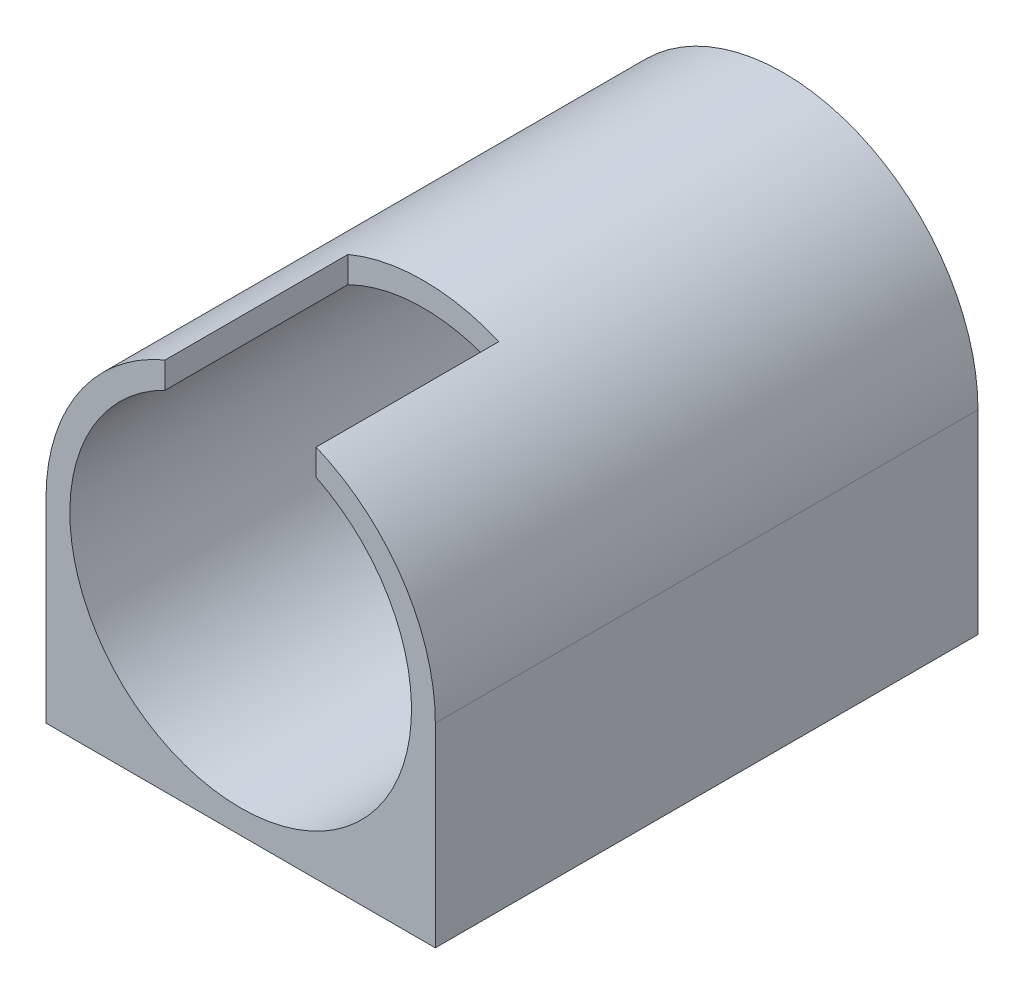
ISO-10303-21;
HEADER;
FILE_DESCRIPTION(('STEP AP214'),'2;1');
FILE_NAME('part.step','',(''),(''),'','','');
FILE_SCHEMA(('AUTOMOTIVE_DESIGN { 1 0 10303 214 1 1 1 1 }'));
ENDSEC;
DATA;
#1=APPLICATION_CONTEXT('core data for automotive mechanical design processes');
#2=APPLICATION_PROTOCOL_DEFINITION('international standard','automotive_design',2000,#1);
#3=PRODUCT_CONTEXT('',#1,'mechanical');
#4=PRODUCT('Part','Part','',(#3));
#5=PRODUCT_RELATED_PRODUCT_CATEGORY('part','',(#4));
#6=PRODUCT_DEFINITION_FORMATION('','',#4);
#7=PRODUCT_DEFINITION_CONTEXT('part definition',#1,'design');
#8=PRODUCT_DEFINITION('design','',#6,#7);
#9=PRODUCT_DEFINITION_SHAPE('','',#8);
#10=(LENGTH_UNIT() NAMED_UNIT(*) SI_UNIT(.MILLI.,.METRE.));
#11=(NAMED_UNIT(*) PLANE_ANGLE_UNIT() SI_UNIT($,.RADIAN.));
#12=(NAMED_UNIT(*) SI_UNIT($,.STERADIAN.) SOLID_ANGLE_UNIT());
#13=UNCERTAINTY_MEASURE_WITH_UNIT(LENGTH_MEASURE(1.E-05),#10,'distance_accuracy_value','');
#14=(GEOMETRIC_REPRESENTATION_CONTEXT(3) GLOBAL_UNCERTAINTY_ASSIGNED_CONTEXT((#13)) GLOBAL_UNIT_ASSIGNED_CONTEXT((#10,
#11,#12)) REPRESENTATION_CONTEXT('',''));
#15=CARTESIAN_POINT('',(0.,0.,0.));
#16=DIRECTION('',(0.,0.,1.));
#17=DIRECTION('',(1.,0.,0.));
#18=AXIS2_PLACEMENT_3D('',#15,#16,#17);
#19=CARTESIAN_POINT('',(24.5,0.,65.3));
#20=DIRECTION('',(-1.,0.,0.));
#21=DIRECTION('',(0.,0.,1.));
#22=AXIS2_PLACEMENT_3D('',#19,#20,#21);
#23=PLANE('',#22);
#24=DIRECTION('',(0.,1.,0.));
#25=VECTOR('',#24,1.);
#26=CARTESIAN_POINT('',(24.5,0.,65.3));
#27=LINE('',#26,#25);
#28=CARTESIAN_POINT('',(24.5,-24.5,65.3));
#29=VERTEX_POINT('',#28);
#30=CARTESIAN_POINT('',(24.5,0.,65.3));
#31=VERTEX_POINT('',#30);
#32=EDGE_CURVE('E66',#29,#31,#27,.T.);
#33=ORIENTED_EDGE('',*,*,#32,.F.);
#34=DIRECTION('',(0.,0.,-1.));
#35=VECTOR('',#34,1.);
#36=CARTESIAN_POINT('',(24.5,-24.5,71.));
#37=LINE('',#36,#35);
#38=CARTESIAN_POINT('',(24.5,-24.5,-3.));
#39=VERTEX_POINT('',#38);
#40=EDGE_CURVE('E121',#29,#39,#37,.T.);
#41=ORIENTED_EDGE('',*,*,#40,.T.);
#42=DIRECTION('',(0.,-1.,0.));
#43=VECTOR('',#42,1.);
#44=CARTESIAN_POINT('',(24.5,0.,-3.));
#45=LINE('',#44,#43);
#46=CARTESIAN_POINT('',(24.5,0.,-3.));
#47=VERTEX_POINT('',#46);
#48=EDGE_CURVE('E110',#47,#39,#45,.T.);
#49=ORIENTED_EDGE('',*,*,#48,.F.);
#50=DIRECTION('',(0.,0.,-1.));
#51=VECTOR('',#50,1.);
#52=CARTESIAN_POINT('',(24.5,0.,65.3));
#53=LINE('',#52,#51);
#54=EDGE_CURVE('E152',#31,#47,#53,.T.);
#55=ORIENTED_EDGE('',*,*,#54,.F.);
#56=EDGE_LOOP('',(#33,#41,#49,#55));
#57=FACE_BOUND('',#56,.T.);
#58=ADVANCED_FACE('F41',(#57),#23,.F.);
#59=CARTESIAN_POINT('',(-24.5,0.,65.3));
#60=DIRECTION('',(-1.,0.,0.));
#61=DIRECTION('',(0.,0.,1.));
#62=AXIS2_PLACEMENT_3D('',#59,#60,#61);
#63=PLANE('',#62);
#64=DIRECTION('',(0.,1.,0.));
#65=VECTOR('',#64,1.);
#66=CARTESIAN_POINT('',(-24.5,0.,-3.));
#67=LINE('',#66,#65);
#68=CARTESIAN_POINT('',(-24.5,-24.5,-3.));
#69=VERTEX_POINT('',#68);
#70=CARTESIAN_POINT('',(-24.5,0.,-3.));
#71=VERTEX_POINT('',#70);
#72=EDGE_CURVE('E130',#69,#71,#67,.T.);
#73=ORIENTED_EDGE('',*,*,#72,.F.);
#74=DIRECTION('',(0.,0.,-1.));
#75=VECTOR('',#74,1.);
#76=CARTESIAN_POINT('',(-24.5,-24.5,71.));
#77=LINE('',#76,#75);
#78=CARTESIAN_POINT('',(-24.5,-24.5,65.3));
#79=VERTEX_POINT('',#78);
#80=EDGE_CURVE('E125',#79,#69,#77,.T.);
#81=ORIENTED_EDGE('',*,*,#80,.F.);
#82=DIRECTION('',(0.,1.,0.));
#83=VECTOR('',#82,1.);
#84=CARTESIAN_POINT('',(-24.5,0.,65.3));
#85=LINE('',#84,#83);
#86=CARTESIAN_POINT('',(-24.5,0.,65.3));
#87=VERTEX_POINT('',#86);
#88=EDGE_CURVE('E147',#79,#87,#85,.T.);
#89=ORIENTED_EDGE('',*,*,#88,.T.);
#90=DIRECTION('',(0.,0.,-1.));
#91=VECTOR('',#90,1.);
#92=CARTESIAN_POINT('',(-24.5,0.,65.3));
#93=LINE('',#92,#91);
#94=EDGE_CURVE('E156',#87,#71,#93,.T.);
#95=ORIENTED_EDGE('',*,*,#94,.T.);
#96=EDGE_LOOP('',(#73,#81,#89,#95));
#97=FACE_BOUND('',#96,.T.);
#98=ADVANCED_FACE('F255',(#97),#63,.T.);
#99=CARTESIAN_POINT('',(0.,0.,65.3));
#100=DIRECTION('',(0.,0.,-1.));
#101=DIRECTION('',(-1.,0.,0.));
#102=AXIS2_PLACEMENT_3D('',#99,#100,#101);
#103=CYLINDRICAL_SURFACE('',#102,24.5);
#104=CARTESIAN_POINT('',(0.,0.,65.3));
#105=DIRECTION('',(0.,0.,1.));
#106=DIRECTION('',(1.,0.,0.));
#107=AXIS2_PLACEMENT_3D('',#104,#105,#106);
#108=CIRCLE('',#107,24.5);
#109=CARTESIAN_POINT('',(-9.5,22.5831795812724,65.3));
#110=VERTEX_POINT('',#109);
#111=EDGE_CURVE('E144',#110,#87,#108,.T.);
#112=ORIENTED_EDGE('',*,*,#111,.F.);
#113=DIRECTION('',(0.,0.,-1.));
#114=VECTOR('',#113,1.);
#115=CARTESIAN_POINT('',(-9.5,22.5831795812724,65.3));
#116=LINE('',#115,#114);
#117=CARTESIAN_POINT('',(-9.5,22.5831795812724,42.3));
#118=VERTEX_POINT('',#117);
#119=EDGE_CURVE('E205',#110,#118,#116,.T.);
#120=ORIENTED_EDGE('',*,*,#119,.T.);
#121=CARTESIAN_POINT('',(0.,0.,42.3));
#122=DIRECTION('',(0.,0.,-1.));
#123=DIRECTION('',(-1.,0.,0.));
#124=AXIS2_PLACEMENT_3D('',#121,#122,#123);
#125=CIRCLE('',#124,24.5);
#126=CARTESIAN_POINT('',(9.5,22.5831795812724,42.3));
#127=VERTEX_POINT('',#126);
#128=EDGE_CURVE('E208',#118,#127,#125,.T.);
#129=ORIENTED_EDGE('',*,*,#128,.T.);
#130=DIRECTION('',(0.,0.,-1.));
#131=VECTOR('',#130,1.);
#132=CARTESIAN_POINT('',(9.5,22.5831795812724,65.3));
#133=LINE('',#132,#131);
#134=CARTESIAN_POINT('',(9.5,22.5831795812724,65.3));
#135=VERTEX_POINT('',#134);
#136=EDGE_CURVE('E200',#127,#135,#133,.F.);
#137=ORIENTED_EDGE('',*,*,#136,.T.);
#138=EDGE_CURVE('E145',#31,#135,#108,.T.);
#139=ORIENTED_EDGE('',*,*,#138,.F.);
#140=ORIENTED_EDGE('',*,*,#54,.T.);
#141=CARTESIAN_POINT('',(0.,0.,-3.));
#142=DIRECTION('',(0.,0.,-1.));
#143=DIRECTION('',(-1.,0.,0.));
#144=AXIS2_PLACEMENT_3D('',#141,#142,#143);
#145=CIRCLE('',#144,24.5);
#146=EDGE_CURVE('E117',#71,#47,#145,.T.);
#147=ORIENTED_EDGE('',*,*,#146,.F.);
#148=ORIENTED_EDGE('',*,*,#94,.F.);
#149=EDGE_LOOP('',(#112,#120,#129,#137,#139,#140,#147,#148));
#150=FACE_BOUND('',#149,.T.);
#151=ADVANCED_FACE('F261',(#150),#103,.T.);
#152=CARTESIAN_POINT('',(0.,-24.5,65.3));
#153=DIRECTION('',(0.,1.,0.));
#154=DIRECTION('',(0.,0.,1.));
#155=AXIS2_PLACEMENT_3D('',#152,#153,#154);
#156=PLANE('',#155);
#157=CARTESIAN_POINT('',(-19.5,-24.5,7.00000000000001));
#158=DIRECTION('',(0.,-1.,0.));
#159=DIRECTION('',(0.,0.,1.));
#160=AXIS2_PLACEMENT_3D('',#157,#158,#159);
#161=CIRCLE('',#160,3.5);
#162=CARTESIAN_POINT('',(-19.5,-24.5,10.5));
#163=VERTEX_POINT('',#162);
#164=EDGE_CURVE('E171',#163,#163,#161,.T.);
#165=ORIENTED_EDGE('',*,*,#164,.F.);
#166=EDGE_LOOP('',(#165));
#167=FACE_BOUND('',#166,.T.);
#168=CARTESIAN_POINT('',(19.5,-24.5,7.00000000000001));
#169=DIRECTION('',(0.,-1.,0.));
#170=DIRECTION('',(0.,0.,-1.));
#171=AXIS2_PLACEMENT_3D('',#168,#169,#170);
#172=CIRCLE('',#171,3.5);
#173=CARTESIAN_POINT('',(19.5,-24.5,3.50000000000001));
#174=VERTEX_POINT('',#173);
#175=EDGE_CURVE('E180',#174,#174,#172,.T.);
#176=ORIENTED_EDGE('',*,*,#175,.F.);
#177=EDGE_LOOP('',(#176));
#178=FACE_BOUND('',#177,.T.);
#179=CARTESIAN_POINT('',(19.5,-24.5,55.3));
#180=DIRECTION('',(0.,-1.,0.));
#181=DIRECTION('',(0.,0.,1.));
#182=AXIS2_PLACEMENT_3D('',#179,#180,#181);
#183=CIRCLE('',#182,3.5);
#184=CARTESIAN_POINT('',(19.5,-24.5,58.8));
#185=VERTEX_POINT('',#184);
#186=EDGE_CURVE('E647',#185,#185,#183,.T.);
#187=ORIENTED_EDGE('',*,*,#186,.F.);
#188=EDGE_LOOP('',(#187));
#189=FACE_BOUND('',#188,.T.);
#190=CARTESIAN_POINT('',(-19.5,-24.5,55.3));
#191=DIRECTION('',(0.,-1.,0.));
#192=DIRECTION('',(0.,0.,-1.));
#193=AXIS2_PLACEMENT_3D('',#190,#191,#192);
#194=CIRCLE('',#193,3.5);
#195=CARTESIAN_POINT('',(-19.5,-24.5,51.8));
#196=VERTEX_POINT('',#195);
#197=EDGE_CURVE('E188',#196,#196,#194,.T.);
#198=ORIENTED_EDGE('',*,*,#197,.F.);
#199=EDGE_LOOP('',(#198));
#200=FACE_BOUND('',#199,.T.);
#201=DIRECTION('',(-1.,0.,0.));
#202=VECTOR('',#201,1.);
#203=CARTESIAN_POINT('',(0.,-24.5,-3.));
#204=LINE('',#203,#202);
#205=EDGE_CURVE('E115',#39,#69,#204,.T.);
#206=ORIENTED_EDGE('',*,*,#205,.F.);
#207=ORIENTED_EDGE('',*,*,#40,.F.);
#208=DIRECTION('',(1.,0.,0.));
#209=VECTOR('',#208,1.);
#210=CARTESIAN_POINT('',(0.,-24.5,65.3));
#211=LINE('',#210,#209);
#212=EDGE_CURVE('E149',#79,#29,#211,.T.);
#213=ORIENTED_EDGE('',*,*,#212,.F.);
#214=ORIENTED_EDGE('',*,*,#80,.T.);
#215=EDGE_LOOP('',(#206,#207,#213,#214));
#216=FACE_BOUND('',#215,.T.);
#217=ADVANCED_FACE('F128',(#167,#178,#189,#200,#216),#156,.F.);
#218=CARTESIAN_POINT('',(0.,0.,65.3));
#219=DIRECTION('',(0.,0.,-1.));
#220=DIRECTION('',(-1.,0.,0.));
#221=AXIS2_PLACEMENT_3D('',#218,#219,#220);
#222=CYLINDRICAL_SURFACE('',#221,21.5);
#223=DIRECTION('',(0.,0.,1.));
#224=VECTOR('',#223,1.);
#225=CARTESIAN_POINT('',(-9.5,19.2873015219859,42.3));
#226=LINE('',#225,#224);
#227=CARTESIAN_POINT('',(-9.5,19.2873015219859,42.3));
#228=VERTEX_POINT('',#227);
#229=CARTESIAN_POINT('',(-9.5,19.2873015219859,65.3));
#230=VERTEX_POINT('',#229);
#231=EDGE_CURVE('E197',#228,#230,#226,.T.);
#232=ORIENTED_EDGE('',*,*,#231,.T.);
#233=CARTESIAN_POINT('',(0.,0.,65.3));
#234=DIRECTION('',(0.,0.,1.));
#235=DIRECTION('',(1.,0.,0.));
#236=AXIS2_PLACEMENT_3D('',#233,#234,#235);
#237=CIRCLE('',#236,21.5);
#238=CARTESIAN_POINT('',(9.5,19.2873015219859,65.3));
#239=VERTEX_POINT('',#238);
#240=EDGE_CURVE('E141',#230,#239,#237,.T.);
#241=ORIENTED_EDGE('',*,*,#240,.T.);
#242=DIRECTION('',(0.,0.,1.));
#243=VECTOR('',#242,1.);
#244=CARTESIAN_POINT('',(9.5,19.2873015219859,42.3));
#245=LINE('',#244,#243);
#246=CARTESIAN_POINT('',(9.5,19.2873015219859,42.3));
#247=VERTEX_POINT('',#246);
#248=EDGE_CURVE('E58',#247,#239,#245,.T.);
#249=ORIENTED_EDGE('',*,*,#248,.F.);
#250=CARTESIAN_POINT('',(0.,0.,42.3));
#251=DIRECTION('',(0.,0.,-1.));
#252=DIRECTION('',(-1.,0.,0.));
#253=AXIS2_PLACEMENT_3D('',#250,#251,#252);
#254=CIRCLE('',#253,21.5);
#255=EDGE_CURVE('E11',#228,#247,#254,.T.);
#256=ORIENTED_EDGE('',*,*,#255,.F.);
#257=EDGE_LOOP('',(#232,#241,#249,#256));
#258=FACE_BOUND('',#257,.T.);
#259=CARTESIAN_POINT('',(0.,0.,0.));
#260=DIRECTION('',(0.,0.,1.));
#261=DIRECTION('',(1.,0.,0.));
#262=AXIS2_PLACEMENT_3D('',#259,#260,#261);
#263=CIRCLE('',#262,21.5);
#264=CARTESIAN_POINT('',(21.5,0.,0.));
#265=VERTEX_POINT('',#264);
#266=EDGE_CURVE('E132',#265,#265,#263,.T.);
#267=ORIENTED_EDGE('',*,*,#266,.F.);
#268=EDGE_LOOP('',(#267));
#269=FACE_BOUND('',#268,.T.);
#270=ADVANCED_FACE('F43',(#258,#269),#222,.F.);
#271=CARTESIAN_POINT('',(0.,0.,65.3));
#272=DIRECTION('',(0.,0.,1.));
#273=DIRECTION('',(1.,0.,0.));
#274=AXIS2_PLACEMENT_3D('',#271,#272,#273);
#275=PLANE('',#274);
#276=ORIENTED_EDGE('',*,*,#212,.T.);
#277=ORIENTED_EDGE('',*,*,#32,.T.);
#278=ORIENTED_EDGE('',*,*,#138,.T.);
#279=DIRECTION('',(0.,1.,0.));
#280=VECTOR('',#279,1.);
#281=CARTESIAN_POINT('',(9.5,25.0256688603933,65.3));
#282=LINE('',#281,#280);
#283=EDGE_CURVE('E187',#239,#135,#282,.T.);
#284=ORIENTED_EDGE('',*,*,#283,.F.);
#285=ORIENTED_EDGE('',*,*,#240,.F.);
#286=DIRECTION('',(0.,-1.,0.));
#287=VECTOR('',#286,1.);
#288=CARTESIAN_POINT('',(-9.5,0.,65.3));
#289=LINE('',#288,#287);
#290=EDGE_CURVE('E50',#110,#230,#289,.T.);
#291=ORIENTED_EDGE('',*,*,#290,.F.);
#292=ORIENTED_EDGE('',*,*,#111,.T.);
#293=ORIENTED_EDGE('',*,*,#88,.F.);
#294=EDGE_LOOP('',(#276,#277,#278,#284,#285,#291,#292,#293));
#295=FACE_BOUND('',#294,.T.);
#296=ADVANCED_FACE('F266',(#295),#275,.T.);
#297=CARTESIAN_POINT('',(0.,0.,0.));
#298=DIRECTION('',(0.,0.,-1.));
#299=DIRECTION('',(-1.,0.,0.));
#300=AXIS2_PLACEMENT_3D('',#297,#298,#299);
#301=PLANE('',#300);
#302=CARTESIAN_POINT('',(17.5,0.,0.));
#303=DIRECTION('',(0.,0.,-1.));
#304=DIRECTION('',(-1.,0.,0.));
#305=AXIS2_PLACEMENT_3D('',#302,#303,#304);
#306=CIRCLE('',#305,1.65);
#307=CARTESIAN_POINT('',(15.85,0.,0.));
#308=VERTEX_POINT('',#307);
#309=EDGE_CURVE('E140',#308,#308,#306,.T.);
#310=ORIENTED_EDGE('',*,*,#309,.T.);
#311=EDGE_LOOP('',(#310));
#312=FACE_BOUND('',#311,.T.);
#313=CARTESIAN_POINT('',(-17.5,0.,0.));
#314=DIRECTION('',(0.,0.,-1.));
#315=DIRECTION('',(-1.,0.,0.));
#316=AXIS2_PLACEMENT_3D('',#313,#314,#315);
#317=CIRCLE('',#316,1.65);
#318=CARTESIAN_POINT('',(-19.15,0.,0.));
#319=VERTEX_POINT('',#318);
#320=EDGE_CURVE('E217',#319,#319,#317,.T.);
#321=ORIENTED_EDGE('',*,*,#320,.T.);
#322=EDGE_LOOP('',(#321));
#323=FACE_BOUND('',#322,.T.);
#324=CARTESIAN_POINT('',(0.,17.5,0.));
#325=DIRECTION('',(0.,0.,-1.));
#326=DIRECTION('',(-1.,0.,0.));
#327=AXIS2_PLACEMENT_3D('',#324,#325,#326);
#328=CIRCLE('',#327,1.65);
#329=CARTESIAN_POINT('',(-1.64999999999999,17.5,0.));
#330=VERTEX_POINT('',#329);
#331=EDGE_CURVE('E223',#330,#330,#328,.T.);
#332=ORIENTED_EDGE('',*,*,#331,.T.);
#333=EDGE_LOOP('',(#332));
#334=FACE_BOUND('',#333,.T.);
#335=CARTESIAN_POINT('',(0.,-17.5,0.));
#336=DIRECTION('',(0.,0.,-1.));
#337=DIRECTION('',(-1.,0.,0.));
#338=AXIS2_PLACEMENT_3D('',#335,#336,#337);
#339=CIRCLE('',#338,1.65);
#340=CARTESIAN_POINT('',(-1.65,-17.5,0.));
#341=VERTEX_POINT('',#340);
#342=EDGE_CURVE('E229',#341,#341,#339,.T.);
#343=ORIENTED_EDGE('',*,*,#342,.T.);
#344=EDGE_LOOP('',(#343));
#345=FACE_BOUND('',#344,.T.);
#346=CARTESIAN_POINT('',(0.,0.,0.));
#347=DIRECTION('',(0.,0.,-1.));
#348=DIRECTION('',(-1.,0.,0.));
#349=AXIS2_PLACEMENT_3D('',#346,#347,#348);
#350=CIRCLE('',#349,14.5);
#351=CARTESIAN_POINT('',(-14.5,0.,0.));
#352=VERTEX_POINT('',#351);
#353=EDGE_CURVE('E136',#352,#352,#350,.T.);
#354=ORIENTED_EDGE('',*,*,#353,.T.);
#355=EDGE_LOOP('',(#354));
#356=FACE_BOUND('',#355,.T.);
#357=ORIENTED_EDGE('',*,*,#266,.T.);
#358=EDGE_LOOP('',(#357));
#359=FACE_BOUND('',#358,.T.);
#360=ADVANCED_FACE('F251',(#312,#323,#334,#345,#356,#359),#301,.F.);
#361=CARTESIAN_POINT('',(0.,0.,-3.));
#362=DIRECTION('',(0.,0.,1.));
#363=DIRECTION('',(1.,0.,0.));
#364=AXIS2_PLACEMENT_3D('',#361,#362,#363);
#365=CYLINDRICAL_SURFACE('',#364,14.5);
#366=CARTESIAN_POINT('',(0.,0.,-3.));
#367=DIRECTION('',(0.,0.,-1.));
#368=DIRECTION('',(-1.,0.,0.));
#369=AXIS2_PLACEMENT_3D('',#366,#367,#368);
#370=CIRCLE('',#369,14.5);
#371=CARTESIAN_POINT('',(-14.5,0.,-3.));
#372=VERTEX_POINT('',#371);
#373=EDGE_CURVE('E139',#372,#372,#370,.T.);
#374=ORIENTED_EDGE('',*,*,#373,.T.);
#375=EDGE_LOOP('',(#374));
#376=FACE_BOUND('',#375,.T.);
#377=ORIENTED_EDGE('',*,*,#353,.F.);
#378=EDGE_LOOP('',(#377));
#379=FACE_BOUND('',#378,.T.);
#380=ADVANCED_FACE('F237',(#376,#379),#365,.F.);
#381=CARTESIAN_POINT('',(0.,0.,-3.));
#382=DIRECTION('',(0.,0.,-1.));
#383=DIRECTION('',(-1.,0.,0.));
#384=AXIS2_PLACEMENT_3D('',#381,#382,#383);
#385=PLANE('',#384);
#386=ORIENTED_EDGE('',*,*,#48,.T.);
#387=ORIENTED_EDGE('',*,*,#205,.T.);
#388=ORIENTED_EDGE('',*,*,#72,.T.);
#389=ORIENTED_EDGE('',*,*,#146,.T.);
#390=EDGE_LOOP('',(#386,#387,#388,#389));
#391=FACE_BOUND('',#390,.T.);
#392=CARTESIAN_POINT('',(17.5,0.,-3.));
#393=DIRECTION('',(0.,0.,-1.));
#394=DIRECTION('',(-1.,0.,0.));
#395=AXIS2_PLACEMENT_3D('',#392,#393,#394);
#396=CIRCLE('',#395,1.65);
#397=CARTESIAN_POINT('',(15.85,0.,-3.));
#398=VERTEX_POINT('',#397);
#399=EDGE_CURVE('E214',#398,#398,#396,.T.);
#400=ORIENTED_EDGE('',*,*,#399,.F.);
#401=EDGE_LOOP('',(#400));
#402=FACE_BOUND('',#401,.T.);
#403=CARTESIAN_POINT('',(-17.5,0.,-3.));
#404=DIRECTION('',(0.,0.,-1.));
#405=DIRECTION('',(-1.,0.,0.));
#406=AXIS2_PLACEMENT_3D('',#403,#404,#405);
#407=CIRCLE('',#406,1.65);
#408=CARTESIAN_POINT('',(-19.15,0.,-3.));
#409=VERTEX_POINT('',#408);
#410=EDGE_CURVE('E220',#409,#409,#407,.T.);
#411=ORIENTED_EDGE('',*,*,#410,.F.);
#412=EDGE_LOOP('',(#411));
#413=FACE_BOUND('',#412,.T.);
#414=CARTESIAN_POINT('',(0.,17.5,-3.));
#415=DIRECTION('',(0.,0.,-1.));
#416=DIRECTION('',(-1.,0.,0.));
#417=AXIS2_PLACEMENT_3D('',#414,#415,#416);
#418=CIRCLE('',#417,1.65);
#419=CARTESIAN_POINT('',(-1.64999999999999,17.5,-3.));
#420=VERTEX_POINT('',#419);
#421=EDGE_CURVE('E226',#420,#420,#418,.T.);
#422=ORIENTED_EDGE('',*,*,#421,.F.);
#423=EDGE_LOOP('',(#422));
#424=FACE_BOUND('',#423,.T.);
#425=CARTESIAN_POINT('',(0.,-17.5,-3.));
#426=DIRECTION('',(0.,0.,-1.));
#427=DIRECTION('',(-1.,0.,0.));
#428=AXIS2_PLACEMENT_3D('',#425,#426,#427);
#429=CIRCLE('',#428,1.65);
#430=CARTESIAN_POINT('',(-1.65,-17.5,-3.));
#431=VERTEX_POINT('',#430);
#432=EDGE_CURVE('E211',#431,#431,#429,.T.);
#433=ORIENTED_EDGE('',*,*,#432,.F.);
#434=EDGE_LOOP('',(#433));
#435=FACE_BOUND('',#434,.T.);
#436=ORIENTED_EDGE('',*,*,#373,.F.);
#437=EDGE_LOOP('',(#436));
#438=FACE_BOUND('',#437,.T.);
#439=ADVANCED_FACE('F112',(#391,#402,#413,#424,#435,#438),#385,.T.);
#440=CARTESIAN_POINT('',(0.,-17.5,0.));
#441=DIRECTION('',(0.,0.,-1.));
#442=DIRECTION('',(-1.,0.,0.));
#443=AXIS2_PLACEMENT_3D('',#440,#441,#442);
#444=CYLINDRICAL_SURFACE('',#443,1.65);
#445=ORIENTED_EDGE('',*,*,#342,.F.);
#446=EDGE_LOOP('',(#445));
#447=FACE_BOUND('',#446,.T.);
#448=ORIENTED_EDGE('',*,*,#432,.T.);
#449=EDGE_LOOP('',(#448));
#450=FACE_BOUND('',#449,.T.);
#451=ADVANCED_FACE('F241',(#447,#450),#444,.F.);
#452=CARTESIAN_POINT('',(0.,17.5,0.));
#453=DIRECTION('',(0.,0.,-1.));
#454=DIRECTION('',(-1.,0.,0.));
#455=AXIS2_PLACEMENT_3D('',#452,#453,#454);
#456=CYLINDRICAL_SURFACE('',#455,1.65);
#457=ORIENTED_EDGE('',*,*,#331,.F.);
#458=EDGE_LOOP('',(#457));
#459=FACE_BOUND('',#458,.T.);
#460=ORIENTED_EDGE('',*,*,#421,.T.);
#461=EDGE_LOOP('',(#460));
#462=FACE_BOUND('',#461,.T.);
#463=ADVANCED_FACE('F247',(#459,#462),#456,.F.);
#464=CARTESIAN_POINT('',(-17.5,0.,0.));
#465=DIRECTION('',(0.,0.,-1.));
#466=DIRECTION('',(-1.,0.,0.));
#467=AXIS2_PLACEMENT_3D('',#464,#465,#466);
#468=CYLINDRICAL_SURFACE('',#467,1.65);
#469=ORIENTED_EDGE('',*,*,#320,.F.);
#470=EDGE_LOOP('',(#469));
#471=FACE_BOUND('',#470,.T.);
#472=ORIENTED_EDGE('',*,*,#410,.T.);
#473=EDGE_LOOP('',(#472));
#474=FACE_BOUND('',#473,.T.);
#475=ADVANCED_FACE('F306',(#471,#474),#468,.F.);
#476=CARTESIAN_POINT('',(17.5,0.,0.));
#477=DIRECTION('',(0.,0.,-1.));
#478=DIRECTION('',(-1.,0.,0.));
#479=AXIS2_PLACEMENT_3D('',#476,#477,#478);
#480=CYLINDRICAL_SURFACE('',#479,1.65);
#481=ORIENTED_EDGE('',*,*,#309,.F.);
#482=EDGE_LOOP('',(#481));
#483=FACE_BOUND('',#482,.T.);
#484=ORIENTED_EDGE('',*,*,#399,.T.);
#485=EDGE_LOOP('',(#484));
#486=FACE_BOUND('',#485,.T.);
#487=ADVANCED_FACE('F303',(#483,#486),#480,.F.);
#488=CARTESIAN_POINT('',(0.,0.,42.3));
#489=DIRECTION('',(0.,0.,-1.));
#490=DIRECTION('',(-1.,0.,0.));
#491=AXIS2_PLACEMENT_3D('',#488,#489,#490);
#492=PLANE('',#491);
#493=DIRECTION('',(0.,-1.,0.));
#494=VECTOR('',#493,1.);
#495=CARTESIAN_POINT('',(-9.5,19.2873015219859,42.3));
#496=LINE('',#495,#494);
#497=EDGE_CURVE('E192',#118,#228,#496,.T.);
#498=ORIENTED_EDGE('',*,*,#497,.T.);
#499=ORIENTED_EDGE('',*,*,#255,.T.);
#500=DIRECTION('',(0.,1.,0.));
#501=VECTOR('',#500,1.);
#502=CARTESIAN_POINT('',(9.5,25.0256688603933,42.3));
#503=LINE('',#502,#501);
#504=EDGE_CURVE('E194',#247,#127,#503,.T.);
#505=ORIENTED_EDGE('',*,*,#504,.T.);
#506=ORIENTED_EDGE('',*,*,#128,.F.);
#507=EDGE_LOOP('',(#498,#499,#505,#506));
#508=FACE_BOUND('',#507,.T.);
#509=ADVANCED_FACE('F288',(#508),#492,.F.);
#510=CARTESIAN_POINT('',(-9.5,19.2873015219859,42.3));
#511=DIRECTION('',(-1.,0.,0.));
#512=DIRECTION('',(0.,0.,1.));
#513=AXIS2_PLACEMENT_3D('',#510,#511,#512);
#514=PLANE('',#513);
#515=ORIENTED_EDGE('',*,*,#290,.T.);
#516=ORIENTED_EDGE('',*,*,#231,.F.);
#517=ORIENTED_EDGE('',*,*,#497,.F.);
#518=ORIENTED_EDGE('',*,*,#119,.F.);
#519=EDGE_LOOP('',(#515,#516,#517,#518));
#520=FACE_BOUND('',#519,.T.);
#521=ADVANCED_FACE('F282',(#520),#514,.F.);
#522=CARTESIAN_POINT('',(9.5,25.0256688603933,42.3));
#523=DIRECTION('',(1.,0.,0.));
#524=DIRECTION('',(0.,0.,-1.));
#525=AXIS2_PLACEMENT_3D('',#522,#523,#524);
#526=PLANE('',#525);
#527=ORIENTED_EDGE('',*,*,#504,.F.);
#528=ORIENTED_EDGE('',*,*,#248,.T.);
#529=ORIENTED_EDGE('',*,*,#283,.T.);
#530=ORIENTED_EDGE('',*,*,#136,.F.);
#531=EDGE_LOOP('',(#527,#528,#529,#530));
#532=FACE_BOUND('',#531,.T.);
#533=ADVANCED_FACE('F289',(#532),#526,.F.);
#534=CARTESIAN_POINT('',(-19.5,-23.5,55.3));
#535=DIRECTION('',(0.,-1.,0.));
#536=DIRECTION('',(0.,0.,-1.));
#537=AXIS2_PLACEMENT_3D('',#534,#535,#536);
#538=CYLINDRICAL_SURFACE('',#537,3.5);
#539=CARTESIAN_POINT('',(-19.5,-23.5,55.3));
#540=DIRECTION('',(0.,-1.,0.));
#541=DIRECTION('',(0.,0.,-1.));
#542=AXIS2_PLACEMENT_3D('',#539,#540,#541);
#543=CIRCLE('',#542,3.5);
#544=CARTESIAN_POINT('',(-19.5,-23.5,51.8));
#545=VERTEX_POINT('',#544);
#546=EDGE_CURVE('E184',#545,#545,#543,.T.);
#547=ORIENTED_EDGE('',*,*,#546,.F.);
#548=EDGE_LOOP('',(#547));
#549=FACE_BOUND('',#548,.T.);
#550=ORIENTED_EDGE('',*,*,#197,.T.);
#551=EDGE_LOOP('',(#550));
#552=FACE_BOUND('',#551,.T.);
#553=ADVANCED_FACE('F291',(#549,#552),#538,.F.);
#554=CARTESIAN_POINT('',(-19.5,-23.5,55.3));
#555=DIRECTION('',(0.,-1.,0.));
#556=DIRECTION('',(0.,0.,-1.));
#557=AXIS2_PLACEMENT_3D('',#554,#555,#556);
#558=PLANE('',#557);
#559=CARTESIAN_POINT('',(-19.5,-23.5,55.3));
#560=DIRECTION('',(0.,-1.,0.));
#561=DIRECTION('',(0.,0.,-1.));
#562=AXIS2_PLACEMENT_3D('',#559,#560,#561);
#563=CIRCLE('',#562,2.75);
#564=CARTESIAN_POINT('',(-19.5,-23.5,52.55));
#565=VERTEX_POINT('',#564);
#566=EDGE_CURVE('E45',#565,#565,#563,.T.);
#567=ORIENTED_EDGE('',*,*,#566,.F.);
#568=EDGE_LOOP('',(#567));
#569=FACE_BOUND('',#568,.T.);
#570=ORIENTED_EDGE('',*,*,#546,.T.);
#571=EDGE_LOOP('',(#570));
#572=FACE_BOUND('',#571,.T.);
#573=ADVANCED_FACE('F297',(#569,#572),#558,.T.);
#574=CARTESIAN_POINT('',(19.5,-23.5,55.3));
#575=DIRECTION('',(0.,-1.,0.));
#576=DIRECTION('',(0.,0.,-1.));
#577=AXIS2_PLACEMENT_3D('',#574,#575,#576);
#578=CYLINDRICAL_SURFACE('',#577,3.5);
#579=CARTESIAN_POINT('',(19.5,-23.5,55.3));
#580=DIRECTION('',(0.,-1.,0.));
#581=DIRECTION('',(0.,0.,1.));
#582=AXIS2_PLACEMENT_3D('',#579,#580,#581);
#583=CIRCLE('',#582,3.5);
#584=CARTESIAN_POINT('',(19.5,-23.5,58.8));
#585=VERTEX_POINT('',#584);
#586=EDGE_CURVE('E191',#585,#585,#583,.T.);
#587=ORIENTED_EDGE('',*,*,#586,.F.);
#588=EDGE_LOOP('',(#587));
#589=FACE_BOUND('',#588,.T.);
#590=ORIENTED_EDGE('',*,*,#186,.T.);
#591=EDGE_LOOP('',(#590));
#592=FACE_BOUND('',#591,.T.);
#593=ADVANCED_FACE('F465',(#589,#592),#578,.F.);
#594=CARTESIAN_POINT('',(19.5,-23.5,55.3));
#595=DIRECTION('',(0.,1.,0.));
#596=DIRECTION('',(0.,0.,1.));
#597=AXIS2_PLACEMENT_3D('',#594,#595,#596);
#598=PLANE('',#597);
#599=CARTESIAN_POINT('',(19.5,-23.5,55.3));
#600=DIRECTION('',(0.,1.,0.));
#601=DIRECTION('',(0.,0.,1.));
#602=AXIS2_PLACEMENT_3D('',#599,#600,#601);
#603=CIRCLE('',#602,2.75);
#604=CARTESIAN_POINT('',(19.5,-23.5,58.05));
#605=VERTEX_POINT('',#604);
#606=EDGE_CURVE('E166',#605,#605,#603,.T.);
#607=ORIENTED_EDGE('',*,*,#606,.T.);
#608=EDGE_LOOP('',(#607));
#609=FACE_BOUND('',#608,.T.);
#610=ORIENTED_EDGE('',*,*,#586,.T.);
#611=EDGE_LOOP('',(#610));
#612=FACE_BOUND('',#611,.T.);
#613=ADVANCED_FACE('F460',(#609,#612),#598,.F.);
#614=CARTESIAN_POINT('',(19.5,-23.5,7.00000000000001));
#615=DIRECTION('',(0.,-1.,0.));
#616=DIRECTION('',(0.,0.,-1.));
#617=AXIS2_PLACEMENT_3D('',#614,#615,#616);
#618=CYLINDRICAL_SURFACE('',#617,3.5);
#619=CARTESIAN_POINT('',(19.5,-23.5,7.00000000000001));
#620=DIRECTION('',(0.,-1.,0.));
#621=DIRECTION('',(0.,0.,-1.));
#622=AXIS2_PLACEMENT_3D('',#619,#620,#621);
#623=CIRCLE('',#622,3.5);
#624=CARTESIAN_POINT('',(19.5,-23.5,3.50000000000001));
#625=VERTEX_POINT('',#624);
#626=EDGE_CURVE('E649',#625,#625,#623,.T.);
#627=ORIENTED_EDGE('',*,*,#626,.F.);
#628=EDGE_LOOP('',(#627));
#629=FACE_BOUND('',#628,.T.);
#630=ORIENTED_EDGE('',*,*,#175,.T.);
#631=EDGE_LOOP('',(#630));
#632=FACE_BOUND('',#631,.T.);
#633=ADVANCED_FACE('F452',(#629,#632),#618,.F.);
#634=CARTESIAN_POINT('',(19.5,-23.5,7.00000000000001));
#635=DIRECTION('',(0.,-1.,0.));
#636=DIRECTION('',(0.,0.,-1.));
#637=AXIS2_PLACEMENT_3D('',#634,#635,#636);
#638=PLANE('',#637);
#639=CARTESIAN_POINT('',(19.5,-23.5,7.00000000000001));
#640=DIRECTION('',(0.,-1.,0.));
#641=DIRECTION('',(0.,0.,-1.));
#642=AXIS2_PLACEMENT_3D('',#639,#640,#641);
#643=CIRCLE('',#642,2.75);
#644=CARTESIAN_POINT('',(19.5,-23.5,4.25000000000001));
#645=VERTEX_POINT('',#644);
#646=EDGE_CURVE('E163',#645,#645,#643,.T.);
#647=ORIENTED_EDGE('',*,*,#646,.F.);
#648=EDGE_LOOP('',(#647));
#649=FACE_BOUND('',#648,.T.);
#650=ORIENTED_EDGE('',*,*,#626,.T.);
#651=EDGE_LOOP('',(#650));
#652=FACE_BOUND('',#651,.T.);
#653=ADVANCED_FACE('F447',(#649,#652),#638,.T.);
#654=CARTESIAN_POINT('',(-19.5,-23.5,7.00000000000001));
#655=DIRECTION('',(0.,-1.,0.));
#656=DIRECTION('',(0.,0.,-1.));
#657=AXIS2_PLACEMENT_3D('',#654,#655,#656);
#658=CYLINDRICAL_SURFACE('',#657,3.5);
#659=CARTESIAN_POINT('',(-19.5,-23.5,7.00000000000001));
#660=DIRECTION('',(0.,-1.,0.));
#661=DIRECTION('',(0.,0.,1.));
#662=AXIS2_PLACEMENT_3D('',#659,#660,#661);
#663=CIRCLE('',#662,3.5);
#664=CARTESIAN_POINT('',(-19.5,-23.5,10.5));
#665=VERTEX_POINT('',#664);
#666=EDGE_CURVE('E175',#665,#665,#663,.T.);
#667=ORIENTED_EDGE('',*,*,#666,.F.);
#668=EDGE_LOOP('',(#667));
#669=FACE_BOUND('',#668,.T.);
#670=ORIENTED_EDGE('',*,*,#164,.T.);
#671=EDGE_LOOP('',(#670));
#672=FACE_BOUND('',#671,.T.);
#673=ADVANCED_FACE('F439',(#669,#672),#658,.F.);
#674=CARTESIAN_POINT('',(-19.5,-23.5,7.00000000000001));
#675=DIRECTION('',(0.,1.,0.));
#676=DIRECTION('',(0.,0.,1.));
#677=AXIS2_PLACEMENT_3D('',#674,#675,#676);
#678=PLANE('',#677);
#679=CARTESIAN_POINT('',(-19.5,-23.5,7.00000000000001));
#680=DIRECTION('',(0.,1.,0.));
#681=DIRECTION('',(0.,0.,1.));
#682=AXIS2_PLACEMENT_3D('',#679,#680,#681);
#683=CIRCLE('',#682,2.75);
#684=CARTESIAN_POINT('',(-19.5,-23.5,9.75000000000001));
#685=VERTEX_POINT('',#684);
#686=EDGE_CURVE('E160',#685,#685,#683,.T.);
#687=ORIENTED_EDGE('',*,*,#686,.T.);
#688=EDGE_LOOP('',(#687));
#689=FACE_BOUND('',#688,.T.);
#690=ORIENTED_EDGE('',*,*,#666,.T.);
#691=EDGE_LOOP('',(#690));
#692=FACE_BOUND('',#691,.T.);
#693=ADVANCED_FACE('F429',(#689,#692),#678,.F.);
#694=CARTESIAN_POINT('',(-19.5,-16.5,7.00000000000001));
#695=DIRECTION('',(0.,-1.,0.));
#696=DIRECTION('',(0.,0.,-1.));
#697=AXIS2_PLACEMENT_3D('',#694,#695,#696);
#698=CYLINDRICAL_SURFACE('',#697,2.75);
#699=CARTESIAN_POINT('',(-19.5,-16.5,7.00000000000001));
#700=DIRECTION('',(0.,-1.,0.));
#701=DIRECTION('',(0.,0.,1.));
#702=AXIS2_PLACEMENT_3D('',#699,#700,#701);
#703=CIRCLE('',#702,2.75);
#704=CARTESIAN_POINT('',(-19.5,-16.5,9.75000000000001));
#705=VERTEX_POINT('',#704);
#706=EDGE_CURVE('E124',#705,#705,#703,.T.);
#707=ORIENTED_EDGE('',*,*,#706,.F.);
#708=EDGE_LOOP('',(#707));
#709=FACE_BOUND('',#708,.T.);
#710=ORIENTED_EDGE('',*,*,#686,.F.);
#711=EDGE_LOOP('',(#710));
#712=FACE_BOUND('',#711,.T.);
#713=ADVANCED_FACE('F419',(#709,#712),#698,.F.);
#714=CARTESIAN_POINT('',(-19.5,-16.5,7.00000000000001));
#715=DIRECTION('',(0.,1.,0.));
#716=DIRECTION('',(0.,0.,1.));
#717=AXIS2_PLACEMENT_3D('',#714,#715,#716);
#718=PLANE('',#717);
#719=ORIENTED_EDGE('',*,*,#706,.T.);
#720=EDGE_LOOP('',(#719));
#721=FACE_BOUND('',#720,.T.);
#722=ADVANCED_FACE('F409',(#721),#718,.F.);
#723=CARTESIAN_POINT('',(19.5,-16.5,7.00000000000001));
#724=DIRECTION('',(0.,-1.,0.));
#725=DIRECTION('',(0.,0.,-1.));
#726=AXIS2_PLACEMENT_3D('',#723,#724,#725);
#727=CYLINDRICAL_SURFACE('',#726,2.75);
#728=ORIENTED_EDGE('',*,*,#646,.T.);
#729=EDGE_LOOP('',(#728));
#730=FACE_BOUND('',#729,.T.);
#731=CARTESIAN_POINT('',(19.5,-16.5,7.00000000000001));
#732=DIRECTION('',(0.,-1.,0.));
#733=DIRECTION('',(0.,0.,-1.));
#734=AXIS2_PLACEMENT_3D('',#731,#732,#733);
#735=CIRCLE('',#734,2.75);
#736=CARTESIAN_POINT('',(19.5,-16.5,4.25000000000001));
#737=VERTEX_POINT('',#736);
#738=EDGE_CURVE('E667',#737,#737,#735,.T.);
#739=ORIENTED_EDGE('',*,*,#738,.F.);
#740=EDGE_LOOP('',(#739));
#741=FACE_BOUND('',#740,.T.);
#742=ADVANCED_FACE('F399',(#730,#741),#727,.F.);
#743=CARTESIAN_POINT('',(19.5,-16.5,7.00000000000001));
#744=DIRECTION('',(0.,-1.,0.));
#745=DIRECTION('',(0.,0.,-1.));
#746=AXIS2_PLACEMENT_3D('',#743,#744,#745);
#747=PLANE('',#746);
#748=ORIENTED_EDGE('',*,*,#738,.T.);
#749=EDGE_LOOP('',(#748));
#750=FACE_BOUND('',#749,.T.);
#751=ADVANCED_FACE('F389',(#750),#747,.T.);
#752=CARTESIAN_POINT('',(19.5,-16.5,55.3));
#753=DIRECTION('',(0.,-1.,0.));
#754=DIRECTION('',(0.,0.,-1.));
#755=AXIS2_PLACEMENT_3D('',#752,#753,#754);
#756=CYLINDRICAL_SURFACE('',#755,2.75);
#757=CARTESIAN_POINT('',(19.5,-16.5,55.3));
#758=DIRECTION('',(0.,-1.,0.));
#759=DIRECTION('',(0.,0.,1.));
#760=AXIS2_PLACEMENT_3D('',#757,#758,#759);
#761=CIRCLE('',#760,2.75);
#762=CARTESIAN_POINT('',(19.5,-16.5,58.05));
#763=VERTEX_POINT('',#762);
#764=EDGE_CURVE('E664',#763,#763,#761,.T.);
#765=ORIENTED_EDGE('',*,*,#764,.F.);
#766=EDGE_LOOP('',(#765));
#767=FACE_BOUND('',#766,.T.);
#768=ORIENTED_EDGE('',*,*,#606,.F.);
#769=EDGE_LOOP('',(#768));
#770=FACE_BOUND('',#769,.T.);
#771=ADVANCED_FACE('F379',(#767,#770),#756,.F.);
#772=CARTESIAN_POINT('',(19.5,-16.5,55.3));
#773=DIRECTION('',(0.,1.,0.));
#774=DIRECTION('',(0.,0.,1.));
#775=AXIS2_PLACEMENT_3D('',#772,#773,#774);
#776=PLANE('',#775);
#777=ORIENTED_EDGE('',*,*,#764,.T.);
#778=EDGE_LOOP('',(#777));
#779=FACE_BOUND('',#778,.T.);
#780=ADVANCED_FACE('F370',(#779),#776,.F.);
#781=CARTESIAN_POINT('',(-19.5,-16.5,55.3));
#782=DIRECTION('',(0.,-1.,0.));
#783=DIRECTION('',(0.,0.,-1.));
#784=AXIS2_PLACEMENT_3D('',#781,#782,#783);
#785=CYLINDRICAL_SURFACE('',#784,2.75);
#786=ORIENTED_EDGE('',*,*,#566,.T.);
#787=EDGE_LOOP('',(#786));
#788=FACE_BOUND('',#787,.T.);
#789=CARTESIAN_POINT('',(-19.5,-16.5,55.3));
#790=DIRECTION('',(0.,-1.,0.));
#791=DIRECTION('',(0.,0.,-1.));
#792=AXIS2_PLACEMENT_3D('',#789,#790,#791);
#793=CIRCLE('',#792,2.75);
#794=CARTESIAN_POINT('',(-19.5,-16.5,52.55));
#795=VERTEX_POINT('',#794);
#796=EDGE_CURVE('E164',#795,#795,#793,.T.);
#797=ORIENTED_EDGE('',*,*,#796,.F.);
#798=EDGE_LOOP('',(#797));
#799=FACE_BOUND('',#798,.T.);
#800=ADVANCED_FACE('F360',(#788,#799),#785,.F.);
#801=CARTESIAN_POINT('',(-19.5,-16.5,55.3));
#802=DIRECTION('',(0.,-1.,0.));
#803=DIRECTION('',(0.,0.,-1.));
#804=AXIS2_PLACEMENT_3D('',#801,#802,#803);
#805=PLANE('',#804);
#806=ORIENTED_EDGE('',*,*,#796,.T.);
#807=EDGE_LOOP('',(#806));
#808=FACE_BOUND('',#807,.T.);
#809=ADVANCED_FACE('F356',(#808),#805,.T.);
#810=CLOSED_SHELL('',(#58,#98,#151,#217,#270,#296,#360,#380,#439,#451,#463,#475,#487,#509,#521,
#533,#553,#573,#593,#613,#633,#653,#673,#693,#713,#722,#742,#751,#771,#780,#800,#809));
#811=MANIFOLD_SOLID_BREP('B2',#810);
#812=ADVANCED_BREP_SHAPE_REPRESENTATION('',(#18,#811),#14);
#813=SHAPE_DEFINITION_REPRESENTATION(#9,#812);
ENDSEC;
END-ISO-10303-21;
